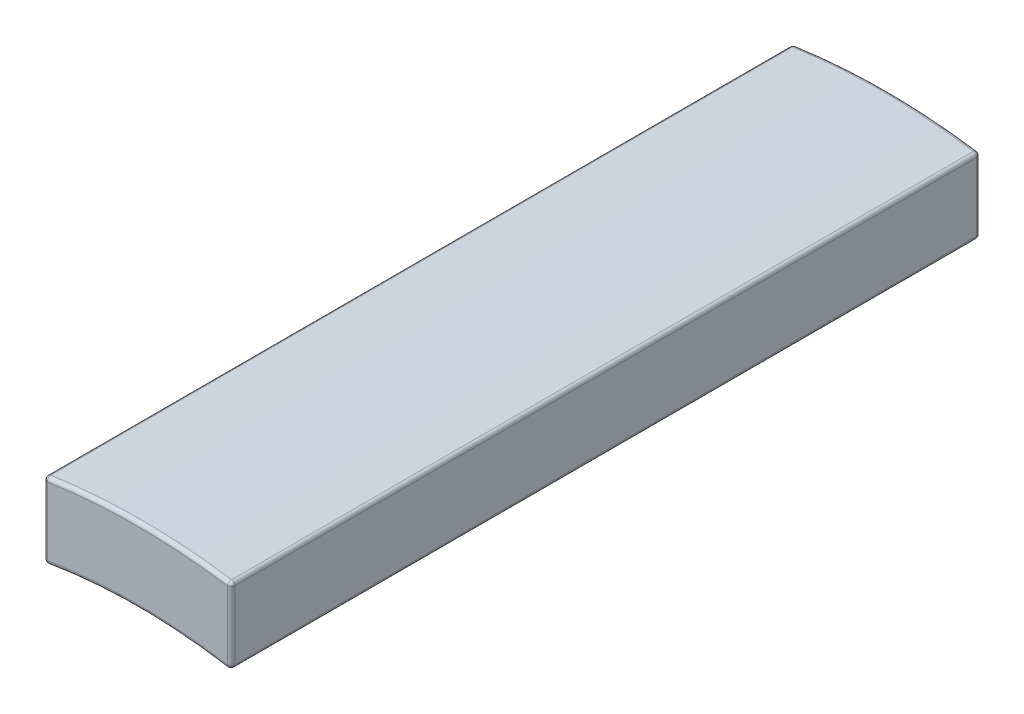
ISO-10303-21;
HEADER;
FILE_DESCRIPTION(('STEP AP214'),'2;1');
FILE_NAME('part.step','',(''),(''),'','','');
FILE_SCHEMA(('AUTOMOTIVE_DESIGN { 1 0 10303 214 1 1 1 1 }'));
ENDSEC;
DATA;
#1=APPLICATION_CONTEXT('core data for automotive mechanical design processes');
#2=APPLICATION_PROTOCOL_DEFINITION('international standard','automotive_design',2000,#1);
#3=PRODUCT_CONTEXT('',#1,'mechanical');
#4=PRODUCT('Part','Part','',(#3));
#5=PRODUCT_RELATED_PRODUCT_CATEGORY('part','',(#4));
#6=PRODUCT_DEFINITION_FORMATION('','',#4);
#7=PRODUCT_DEFINITION_CONTEXT('part definition',#1,'design');
#8=PRODUCT_DEFINITION('design','',#6,#7);
#9=PRODUCT_DEFINITION_SHAPE('','',#8);
#10=(LENGTH_UNIT() NAMED_UNIT(*) SI_UNIT(.MILLI.,.METRE.));
#11=(NAMED_UNIT(*) PLANE_ANGLE_UNIT() SI_UNIT($,.RADIAN.));
#12=(NAMED_UNIT(*) SI_UNIT($,.STERADIAN.) SOLID_ANGLE_UNIT());
#13=UNCERTAINTY_MEASURE_WITH_UNIT(LENGTH_MEASURE(1.E-05),#10,'distance_accuracy_value','');
#14=(GEOMETRIC_REPRESENTATION_CONTEXT(3) GLOBAL_UNCERTAINTY_ASSIGNED_CONTEXT((#13)) GLOBAL_UNIT_ASSIGNED_CONTEXT((#10,
#11,#12)) REPRESENTATION_CONTEXT('',''));
#15=CARTESIAN_POINT('',(0.,0.,0.));
#16=DIRECTION('',(0.,0.,1.));
#17=DIRECTION('',(1.,0.,0.));
#18=AXIS2_PLACEMENT_3D('',#15,#16,#17);
#19=CARTESIAN_POINT('',(2.4,14.3,0.1));
#20=DIRECTION('',(0.,1.,0.));
#21=DIRECTION('',(0.,0.,1.));
#22=AXIS2_PLACEMENT_3D('',#19,#20,#21);
#23=CYLINDRICAL_SURFACE('',#22,0.1);
#24=CARTESIAN_POINT('',(2.4,14.3,0.1));
#25=DIRECTION('',(0.,1.,0.));
#26=DIRECTION('',(0.,0.,1.));
#27=AXIS2_PLACEMENT_3D('',#24,#25,#26);
#28=CIRCLE('',#27,0.1);
#29=CARTESIAN_POINT('',(2.5,14.3,0.1));
#30=VERTEX_POINT('',#29);
#31=CARTESIAN_POINT('',(2.4,14.3,0.));
#32=VERTEX_POINT('',#31);
#33=EDGE_CURVE('E28',#30,#32,#28,.T.);
#34=ORIENTED_EDGE('',*,*,#33,.T.);
#35=DIRECTION('',(0.,-1.,0.));
#36=VECTOR('',#35,1.);
#37=CARTESIAN_POINT('',(2.4,14.3,0.));
#38=LINE('',#37,#36);
#39=CARTESIAN_POINT('',(2.4,16.1223447426235,0.));
#40=VERTEX_POINT('',#39);
#41=EDGE_CURVE('E219',#40,#32,#38,.T.);
#42=ORIENTED_EDGE('',*,*,#41,.F.);
#43=CARTESIAN_POINT('',(2.4,16.1223447426235,0.1));
#44=DIRECTION('',(0.,-1.,0.));
#45=DIRECTION('',(0.,0.,-1.));
#46=AXIS2_PLACEMENT_3D('',#43,#44,#45);
#47=CIRCLE('',#46,0.1);
#48=CARTESIAN_POINT('',(2.5,16.1223447426235,0.1));
#49=VERTEX_POINT('',#48);
#50=EDGE_CURVE('E11',#40,#49,#47,.T.);
#51=ORIENTED_EDGE('',*,*,#50,.T.);
#52=DIRECTION('',(0.,1.,0.));
#53=VECTOR('',#52,1.);
#54=CARTESIAN_POINT('',(2.5,14.3,0.1));
#55=LINE('',#54,#53);
#56=EDGE_CURVE('E276',#30,#49,#55,.T.);
#57=ORIENTED_EDGE('',*,*,#56,.F.);
#58=EDGE_LOOP('',(#34,#42,#51,#57));
#59=FACE_BOUND('',#58,.T.);
#60=ADVANCED_FACE('F17',(#59),#23,.T.);
#61=CARTESIAN_POINT('',(2.4,16.1223447426235,0.1));
#62=DIRECTION('',(0.,1.,0.));
#63=DIRECTION('',(1.,0.,0.));
#64=AXIS2_PLACEMENT_3D('',#61,#62,#63);
#65=SPHERICAL_SURFACE('',#64,0.1);
#66=CARTESIAN_POINT('',(2.4,16.1223447426235,0.1));
#67=DIRECTION('',(0.98910090445543,-0.147239263803684,0.));
#68=DIRECTION('',(0.147239263803684,0.98910090445543,0.));
#69=AXIS2_PLACEMENT_3D('',#66,#67,#68);
#70=CIRCLE('',#69,0.1);
#71=CARTESIAN_POINT('',(2.41472392638037,16.2212548330691,0.1));
#72=VERTEX_POINT('',#71);
#73=EDGE_CURVE('E156',#40,#72,#70,.T.);
#74=ORIENTED_EDGE('',*,*,#73,.T.);
#75=CARTESIAN_POINT('',(2.4,16.1223447426235,0.1));
#76=DIRECTION('',(0.,0.,1.));
#77=DIRECTION('',(-1.,0.,0.));
#78=AXIS2_PLACEMENT_3D('',#75,#76,#77);
#79=CIRCLE('',#78,0.1);
#80=EDGE_CURVE('E209',#49,#72,#79,.T.);
#81=ORIENTED_EDGE('',*,*,#80,.F.);
#82=ORIENTED_EDGE('',*,*,#50,.F.);
#83=EDGE_LOOP('',(#74,#81,#82));
#84=FACE_BOUND('',#83,.T.);
#85=ADVANCED_FACE('F637',(#84),#65,.T.);
#86=CARTESIAN_POINT('',(2.4,14.3,0.1));
#87=DIRECTION('',(0.,1.,0.));
#88=DIRECTION('',(1.,0.,0.));
#89=AXIS2_PLACEMENT_3D('',#86,#87,#88);
#90=SPHERICAL_SURFACE('',#89,0.1);
#91=CARTESIAN_POINT('',(2.4,14.3,0.1));
#92=DIRECTION('',(0.,0.,1.));
#93=DIRECTION('',(-1.,0.,0.));
#94=AXIS2_PLACEMENT_3D('',#91,#92,#93);
#95=CIRCLE('',#94,0.1);
#96=CARTESIAN_POINT('',(2.38344827586207,14.2013793103448,0.1));
#97=VERTEX_POINT('',#96);
#98=EDGE_CURVE('E173',#97,#30,#95,.T.);
#99=ORIENTED_EDGE('',*,*,#98,.F.);
#100=CARTESIAN_POINT('',(2.4,14.3,0.1));
#101=DIRECTION('',(0.986206896551724,-0.165517241379312,0.));
#102=DIRECTION('',(0.165517241379312,0.986206896551724,0.));
#103=AXIS2_PLACEMENT_3D('',#100,#101,#102);
#104=CIRCLE('',#103,0.1);
#105=EDGE_CURVE('E145',#97,#32,#104,.T.);
#106=ORIENTED_EDGE('',*,*,#105,.T.);
#107=ORIENTED_EDGE('',*,*,#33,.F.);
#108=EDGE_LOOP('',(#99,#106,#107));
#109=FACE_BOUND('',#108,.T.);
#110=ADVANCED_FACE('F174',(#109),#90,.T.);
#111=CARTESIAN_POINT('',(0.,0.,0.1));
#112=DIRECTION('',(0.,0.,1.));
#113=DIRECTION('',(1.,0.,0.));
#114=AXIS2_PLACEMENT_3D('',#111,#112,#113);
#115=TOROIDAL_SURFACE('',#114,16.3,0.1);
#116=CARTESIAN_POINT('',(-2.4,16.1223447426235,0.1));
#117=DIRECTION('',(0.98910090445543,0.14723926380368,0.));
#118=DIRECTION('',(-0.14723926380368,0.98910090445543,0.));
#119=AXIS2_PLACEMENT_3D('',#116,#117,#118);
#120=CIRCLE('',#119,0.1);
#121=CARTESIAN_POINT('',(-2.4,16.1223447426235,0.));
#122=VERTEX_POINT('',#121);
#123=CARTESIAN_POINT('',(-2.41472392638037,16.2212548330691,0.1));
#124=VERTEX_POINT('',#123);
#125=EDGE_CURVE('E157',#122,#124,#120,.T.);
#126=ORIENTED_EDGE('',*,*,#125,.T.);
#127=CARTESIAN_POINT('',(0.,0.,0.1));
#128=DIRECTION('',(0.,0.,1.));
#129=DIRECTION('',(1.,0.,0.));
#130=AXIS2_PLACEMENT_3D('',#127,#128,#129);
#131=CIRCLE('',#130,16.4);
#132=EDGE_CURVE('E267',#72,#124,#131,.T.);
#133=ORIENTED_EDGE('',*,*,#132,.F.);
#134=ORIENTED_EDGE('',*,*,#73,.F.);
#135=CARTESIAN_POINT('',(0.,0.,0.));
#136=DIRECTION('',(0.,0.,-1.));
#137=DIRECTION('',(1.,0.,0.));
#138=AXIS2_PLACEMENT_3D('',#135,#136,#137);
#139=CIRCLE('',#138,16.3);
#140=EDGE_CURVE('E215',#122,#40,#139,.T.);
#141=ORIENTED_EDGE('',*,*,#140,.F.);
#142=EDGE_LOOP('',(#126,#133,#134,#141));
#143=FACE_BOUND('',#142,.T.);
#144=ADVANCED_FACE('F548',(#143),#115,.T.);
#145=CARTESIAN_POINT('',(0.,0.,0.1));
#146=DIRECTION('',(0.,0.,1.));
#147=DIRECTION('',(1.,0.,0.));
#148=AXIS2_PLACEMENT_3D('',#145,#146,#147);
#149=TOROIDAL_SURFACE('',#148,14.5,0.1);
#150=CARTESIAN_POINT('',(-2.4,14.3,0.1));
#151=DIRECTION('',(0.986206896551723,0.165517241379316,0.));
#152=DIRECTION('',(-0.165517241379316,0.986206896551723,0.));
#153=AXIS2_PLACEMENT_3D('',#150,#151,#152);
#154=CIRCLE('',#153,0.1);
#155=CARTESIAN_POINT('',(-2.38344827586207,14.2013793103448,0.1));
#156=VERTEX_POINT('',#155);
#157=CARTESIAN_POINT('',(-2.4,14.3,0.));
#158=VERTEX_POINT('',#157);
#159=EDGE_CURVE('E21',#156,#158,#154,.T.);
#160=ORIENTED_EDGE('',*,*,#159,.T.);
#161=CARTESIAN_POINT('',(0.,0.,0.));
#162=DIRECTION('',(0.,0.,1.));
#163=DIRECTION('',(1.,0.,0.));
#164=AXIS2_PLACEMENT_3D('',#161,#162,#163);
#165=CIRCLE('',#164,14.5);
#166=EDGE_CURVE('E151',#32,#158,#165,.T.);
#167=ORIENTED_EDGE('',*,*,#166,.F.);
#168=ORIENTED_EDGE('',*,*,#105,.F.);
#169=CARTESIAN_POINT('',(0.,0.,0.1));
#170=DIRECTION('',(0.,0.,-1.));
#171=DIRECTION('',(1.,0.,0.));
#172=AXIS2_PLACEMENT_3D('',#169,#170,#171);
#173=CIRCLE('',#172,14.4);
#174=EDGE_CURVE('E148',#156,#97,#173,.T.);
#175=ORIENTED_EDGE('',*,*,#174,.F.);
#176=EDGE_LOOP('',(#160,#167,#168,#175));
#177=FACE_BOUND('',#176,.T.);
#178=ADVANCED_FACE('F147',(#177),#149,.T.);
#179=CARTESIAN_POINT('',(-2.4,16.1223447426235,0.1));
#180=DIRECTION('',(0.,1.,0.));
#181=DIRECTION('',(1.,0.,0.));
#182=AXIS2_PLACEMENT_3D('',#179,#180,#181);
#183=SPHERICAL_SURFACE('',#182,0.1);
#184=CARTESIAN_POINT('',(-2.4,16.1223447426235,0.1));
#185=DIRECTION('',(0.,1.,0.));
#186=DIRECTION('',(0.,0.,1.));
#187=AXIS2_PLACEMENT_3D('',#184,#185,#186);
#188=CIRCLE('',#187,0.1);
#189=CARTESIAN_POINT('',(-2.5,16.1223447426235,0.1));
#190=VERTEX_POINT('',#189);
#191=EDGE_CURVE('E251',#122,#190,#188,.T.);
#192=ORIENTED_EDGE('',*,*,#191,.T.);
#193=CARTESIAN_POINT('',(-2.4,16.1223447426235,0.1));
#194=DIRECTION('',(0.,0.,1.));
#195=DIRECTION('',(-1.,0.,0.));
#196=AXIS2_PLACEMENT_3D('',#193,#194,#195);
#197=CIRCLE('',#196,0.1);
#198=EDGE_CURVE('E227',#124,#190,#197,.T.);
#199=ORIENTED_EDGE('',*,*,#198,.F.);
#200=ORIENTED_EDGE('',*,*,#125,.F.);
#201=EDGE_LOOP('',(#192,#199,#200));
#202=FACE_BOUND('',#201,.T.);
#203=ADVANCED_FACE('F561',(#202),#183,.T.);
#204=CARTESIAN_POINT('',(-2.4,14.3,0.1));
#205=DIRECTION('',(0.,1.,0.));
#206=DIRECTION('',(1.,0.,0.));
#207=AXIS2_PLACEMENT_3D('',#204,#205,#206);
#208=SPHERICAL_SURFACE('',#207,0.1);
#209=CARTESIAN_POINT('',(-2.4,14.3,0.1));
#210=DIRECTION('',(0.,0.,1.));
#211=DIRECTION('',(-1.,0.,0.));
#212=AXIS2_PLACEMENT_3D('',#209,#210,#211);
#213=CIRCLE('',#212,0.1);
#214=CARTESIAN_POINT('',(-2.5,14.3,0.1));
#215=VERTEX_POINT('',#214);
#216=EDGE_CURVE('E244',#215,#156,#213,.T.);
#217=ORIENTED_EDGE('',*,*,#216,.F.);
#218=CARTESIAN_POINT('',(-2.4,14.3,0.1));
#219=DIRECTION('',(0.,-1.,0.));
#220=DIRECTION('',(0.,0.,-1.));
#221=AXIS2_PLACEMENT_3D('',#218,#219,#220);
#222=CIRCLE('',#221,0.1);
#223=EDGE_CURVE('E213',#215,#158,#222,.T.);
#224=ORIENTED_EDGE('',*,*,#223,.T.);
#225=ORIENTED_EDGE('',*,*,#159,.F.);
#226=EDGE_LOOP('',(#217,#224,#225));
#227=FACE_BOUND('',#226,.T.);
#228=ADVANCED_FACE('F347',(#227),#208,.T.);
#229=CARTESIAN_POINT('',(-2.4,14.3,0.1));
#230=DIRECTION('',(0.,-1.,0.));
#231=DIRECTION('',(0.,0.,-1.));
#232=AXIS2_PLACEMENT_3D('',#229,#230,#231);
#233=CYLINDRICAL_SURFACE('',#232,0.1);
#234=ORIENTED_EDGE('',*,*,#223,.F.);
#235=DIRECTION('',(0.,-1.,0.));
#236=VECTOR('',#235,1.);
#237=CARTESIAN_POINT('',(-2.5,14.3,0.1));
#238=LINE('',#237,#236);
#239=EDGE_CURVE('E250',#190,#215,#238,.T.);
#240=ORIENTED_EDGE('',*,*,#239,.F.);
#241=ORIENTED_EDGE('',*,*,#191,.F.);
#242=DIRECTION('',(0.,1.,0.));
#243=VECTOR('',#242,1.);
#244=CARTESIAN_POINT('',(-2.4,14.3,0.));
#245=LINE('',#244,#243);
#246=EDGE_CURVE('E198',#158,#122,#245,.T.);
#247=ORIENTED_EDGE('',*,*,#246,.F.);
#248=EDGE_LOOP('',(#234,#240,#241,#247));
#249=FACE_BOUND('',#248,.T.);
#250=ADVANCED_FACE('F560',(#249),#233,.T.);
#251=CARTESIAN_POINT('',(0.,0.,19.9));
#252=DIRECTION('',(0.,0.,1.));
#253=DIRECTION('',(1.,0.,0.));
#254=AXIS2_PLACEMENT_3D('',#251,#252,#253);
#255=TOROIDAL_SURFACE('',#254,14.5,0.1);
#256=CARTESIAN_POINT('',(-2.4,14.3,19.9));
#257=DIRECTION('',(0.986206896551723,0.165517241379316,0.));
#258=DIRECTION('',(-0.165517241379316,0.986206896551723,0.));
#259=AXIS2_PLACEMENT_3D('',#256,#257,#258);
#260=CIRCLE('',#259,0.1);
#261=CARTESIAN_POINT('',(-2.4,14.3,20.));
#262=VERTEX_POINT('',#261);
#263=CARTESIAN_POINT('',(-2.38344827586207,14.2013793103448,19.9));
#264=VERTEX_POINT('',#263);
#265=EDGE_CURVE('E214',#262,#264,#260,.T.);
#266=ORIENTED_EDGE('',*,*,#265,.T.);
#267=CARTESIAN_POINT('',(0.,0.,19.9));
#268=DIRECTION('',(0.,0.,1.));
#269=DIRECTION('',(1.,0.,0.));
#270=AXIS2_PLACEMENT_3D('',#267,#268,#269);
#271=CIRCLE('',#270,14.4);
#272=CARTESIAN_POINT('',(2.38344827586207,14.2013793103448,19.9));
#273=VERTEX_POINT('',#272);
#274=EDGE_CURVE('E169',#273,#264,#271,.T.);
#275=ORIENTED_EDGE('',*,*,#274,.F.);
#276=CARTESIAN_POINT('',(2.4,14.3,19.9));
#277=DIRECTION('',(-0.986206896551725,0.165517241379303,0.));
#278=DIRECTION('',(-0.165517241379303,-0.986206896551725,0.));
#279=AXIS2_PLACEMENT_3D('',#276,#277,#278);
#280=CIRCLE('',#279,0.1);
#281=CARTESIAN_POINT('',(2.4,14.3,20.));
#282=VERTEX_POINT('',#281);
#283=EDGE_CURVE('E76',#273,#282,#280,.T.);
#284=ORIENTED_EDGE('',*,*,#283,.T.);
#285=CARTESIAN_POINT('',(0.,0.,20.));
#286=DIRECTION('',(0.,0.,-1.));
#287=DIRECTION('',(1.,0.,0.));
#288=AXIS2_PLACEMENT_3D('',#285,#286,#287);
#289=CIRCLE('',#288,14.5);
#290=EDGE_CURVE('E199',#262,#282,#289,.T.);
#291=ORIENTED_EDGE('',*,*,#290,.F.);
#292=EDGE_LOOP('',(#266,#275,#284,#291));
#293=FACE_BOUND('',#292,.T.);
#294=ADVANCED_FACE('F341',(#293),#255,.T.);
#295=CARTESIAN_POINT('',(2.4,14.3,19.9));
#296=DIRECTION('',(0.,1.,0.));
#297=DIRECTION('',(1.,0.,0.));
#298=AXIS2_PLACEMENT_3D('',#295,#296,#297);
#299=SPHERICAL_SURFACE('',#298,0.1);
#300=CARTESIAN_POINT('',(2.4,14.3,19.9));
#301=DIRECTION('',(0.,0.,-1.));
#302=DIRECTION('',(-1.,0.,0.));
#303=AXIS2_PLACEMENT_3D('',#300,#301,#302);
#304=CIRCLE('',#303,0.1);
#305=CARTESIAN_POINT('',(2.5,14.3,19.9));
#306=VERTEX_POINT('',#305);
#307=EDGE_CURVE('E184',#306,#273,#304,.T.);
#308=ORIENTED_EDGE('',*,*,#307,.F.);
#309=CARTESIAN_POINT('',(2.4,14.3,19.9));
#310=DIRECTION('',(0.,-1.,0.));
#311=DIRECTION('',(0.,0.,-1.));
#312=AXIS2_PLACEMENT_3D('',#309,#310,#311);
#313=CIRCLE('',#312,0.1);
#314=EDGE_CURVE('E235',#306,#282,#313,.T.);
#315=ORIENTED_EDGE('',*,*,#314,.T.);
#316=ORIENTED_EDGE('',*,*,#283,.F.);
#317=EDGE_LOOP('',(#308,#315,#316));
#318=FACE_BOUND('',#317,.T.);
#319=ADVANCED_FACE('F686',(#318),#299,.T.);
#320=CARTESIAN_POINT('',(-2.4,14.3,19.9));
#321=DIRECTION('',(0.,1.,0.));
#322=DIRECTION('',(1.,0.,0.));
#323=AXIS2_PLACEMENT_3D('',#320,#321,#322);
#324=SPHERICAL_SURFACE('',#323,0.1);
#325=CARTESIAN_POINT('',(-2.4,14.3,19.9));
#326=DIRECTION('',(0.,-1.,0.));
#327=DIRECTION('',(0.,0.,-1.));
#328=AXIS2_PLACEMENT_3D('',#325,#326,#327);
#329=CIRCLE('',#328,0.1);
#330=CARTESIAN_POINT('',(-2.5,14.3,19.9));
#331=VERTEX_POINT('',#330);
#332=EDGE_CURVE('E258',#262,#331,#329,.T.);
#333=ORIENTED_EDGE('',*,*,#332,.T.);
#334=CARTESIAN_POINT('',(-2.4,14.3,19.9));
#335=DIRECTION('',(0.,0.,-1.));
#336=DIRECTION('',(-1.,0.,0.));
#337=AXIS2_PLACEMENT_3D('',#334,#335,#336);
#338=CIRCLE('',#337,0.1);
#339=EDGE_CURVE('E170',#264,#331,#338,.T.);
#340=ORIENTED_EDGE('',*,*,#339,.F.);
#341=ORIENTED_EDGE('',*,*,#265,.F.);
#342=EDGE_LOOP('',(#333,#340,#341));
#343=FACE_BOUND('',#342,.T.);
#344=ADVANCED_FACE('F342',(#343),#324,.T.);
#345=CARTESIAN_POINT('',(2.4,14.3,19.9));
#346=DIRECTION('',(0.,-1.,0.));
#347=DIRECTION('',(0.,0.,-1.));
#348=AXIS2_PLACEMENT_3D('',#345,#346,#347);
#349=CYLINDRICAL_SURFACE('',#348,0.1);
#350=CARTESIAN_POINT('',(2.4,16.1223447426235,19.9));
#351=DIRECTION('',(0.,-1.,0.));
#352=DIRECTION('',(0.,0.,-1.));
#353=AXIS2_PLACEMENT_3D('',#350,#351,#352);
#354=CIRCLE('',#353,0.1);
#355=CARTESIAN_POINT('',(2.5,16.1223447426235,19.9));
#356=VERTEX_POINT('',#355);
#357=CARTESIAN_POINT('',(2.4,16.1223447426235,20.));
#358=VERTEX_POINT('',#357);
#359=EDGE_CURVE('E59',#356,#358,#354,.T.);
#360=ORIENTED_EDGE('',*,*,#359,.T.);
#361=DIRECTION('',(0.,1.,0.));
#362=VECTOR('',#361,1.);
#363=CARTESIAN_POINT('',(2.4,16.1223447426235,20.));
#364=LINE('',#363,#362);
#365=EDGE_CURVE('E203',#282,#358,#364,.T.);
#366=ORIENTED_EDGE('',*,*,#365,.F.);
#367=ORIENTED_EDGE('',*,*,#314,.F.);
#368=DIRECTION('',(0.,-1.,0.));
#369=VECTOR('',#368,1.);
#370=CARTESIAN_POINT('',(2.5,14.3,19.9));
#371=LINE('',#370,#369);
#372=EDGE_CURVE('E205',#356,#306,#371,.T.);
#373=ORIENTED_EDGE('',*,*,#372,.F.);
#374=EDGE_LOOP('',(#360,#366,#367,#373));
#375=FACE_BOUND('',#374,.T.);
#376=ADVANCED_FACE('F646',(#375),#349,.T.);
#377=CARTESIAN_POINT('',(-2.4,14.3,19.9));
#378=DIRECTION('',(0.,1.,0.));
#379=DIRECTION('',(0.,0.,1.));
#380=AXIS2_PLACEMENT_3D('',#377,#378,#379);
#381=CYLINDRICAL_SURFACE('',#380,0.1);
#382=CARTESIAN_POINT('',(-2.4,16.1223447426235,19.9));
#383=DIRECTION('',(0.,-1.,0.));
#384=DIRECTION('',(0.,0.,-1.));
#385=AXIS2_PLACEMENT_3D('',#382,#383,#384);
#386=CIRCLE('',#385,0.1);
#387=CARTESIAN_POINT('',(-2.4,16.1223447426235,20.));
#388=VERTEX_POINT('',#387);
#389=CARTESIAN_POINT('',(-2.5,16.1223447426235,19.9));
#390=VERTEX_POINT('',#389);
#391=EDGE_CURVE('E193',#388,#390,#386,.T.);
#392=ORIENTED_EDGE('',*,*,#391,.T.);
#393=DIRECTION('',(0.,1.,0.));
#394=VECTOR('',#393,1.);
#395=CARTESIAN_POINT('',(-2.5,16.1223447426235,19.9));
#396=LINE('',#395,#394);
#397=EDGE_CURVE('E240',#331,#390,#396,.T.);
#398=ORIENTED_EDGE('',*,*,#397,.F.);
#399=ORIENTED_EDGE('',*,*,#332,.F.);
#400=DIRECTION('',(0.,-1.,0.));
#401=VECTOR('',#400,1.);
#402=CARTESIAN_POINT('',(-2.4,14.3,20.));
#403=LINE('',#402,#401);
#404=EDGE_CURVE('E204',#388,#262,#403,.T.);
#405=ORIENTED_EDGE('',*,*,#404,.F.);
#406=EDGE_LOOP('',(#392,#398,#399,#405));
#407=FACE_BOUND('',#406,.T.);
#408=ADVANCED_FACE('F336',(#407),#381,.T.);
#409=CARTESIAN_POINT('',(2.4,16.1223447426235,19.9));
#410=DIRECTION('',(0.,1.,0.));
#411=DIRECTION('',(1.,0.,0.));
#412=AXIS2_PLACEMENT_3D('',#409,#410,#411);
#413=SPHERICAL_SURFACE('',#412,0.1);
#414=CARTESIAN_POINT('',(2.4,16.1223447426235,19.9));
#415=DIRECTION('',(0.,0.,-1.));
#416=DIRECTION('',(-1.,0.,0.));
#417=AXIS2_PLACEMENT_3D('',#414,#415,#416);
#418=CIRCLE('',#417,0.1);
#419=CARTESIAN_POINT('',(2.41472392638037,16.2212548330691,19.9));
#420=VERTEX_POINT('',#419);
#421=EDGE_CURVE('E271',#420,#356,#418,.T.);
#422=ORIENTED_EDGE('',*,*,#421,.F.);
#423=CARTESIAN_POINT('',(2.4,16.1223447426235,19.9));
#424=DIRECTION('',(0.98910090445543,-0.14723926380368,0.));
#425=DIRECTION('',(0.14723926380368,0.98910090445543,0.));
#426=AXIS2_PLACEMENT_3D('',#423,#424,#425);
#427=CIRCLE('',#426,0.1);
#428=EDGE_CURVE('E194',#420,#358,#427,.T.);
#429=ORIENTED_EDGE('',*,*,#428,.T.);
#430=ORIENTED_EDGE('',*,*,#359,.F.);
#431=EDGE_LOOP('',(#422,#429,#430));
#432=FACE_BOUND('',#431,.T.);
#433=ADVANCED_FACE('F628',(#432),#413,.T.);
#434=CARTESIAN_POINT('',(-2.4,16.1223447426235,19.9));
#435=DIRECTION('',(0.,1.,0.));
#436=DIRECTION('',(1.,0.,0.));
#437=AXIS2_PLACEMENT_3D('',#434,#435,#436);
#438=SPHERICAL_SURFACE('',#437,0.1);
#439=CARTESIAN_POINT('',(-2.4,16.1223447426235,19.9));
#440=DIRECTION('',(-0.98910090445543,-0.14723926380368,0.));
#441=DIRECTION('',(0.14723926380368,-0.98910090445543,0.));
#442=AXIS2_PLACEMENT_3D('',#439,#440,#441);
#443=CIRCLE('',#442,0.1);
#444=CARTESIAN_POINT('',(-2.41472392638037,16.2212548330691,19.9));
#445=VERTEX_POINT('',#444);
#446=EDGE_CURVE('E191',#388,#445,#443,.T.);
#447=ORIENTED_EDGE('',*,*,#446,.T.);
#448=CARTESIAN_POINT('',(-2.4,16.1223447426235,19.9));
#449=DIRECTION('',(0.,0.,-1.));
#450=DIRECTION('',(-1.,0.,0.));
#451=AXIS2_PLACEMENT_3D('',#448,#449,#450);
#452=CIRCLE('',#451,0.1);
#453=EDGE_CURVE('E246',#390,#445,#452,.T.);
#454=ORIENTED_EDGE('',*,*,#453,.F.);
#455=ORIENTED_EDGE('',*,*,#391,.F.);
#456=EDGE_LOOP('',(#447,#454,#455));
#457=FACE_BOUND('',#456,.T.);
#458=ADVANCED_FACE('F597',(#457),#438,.T.);
#459=CARTESIAN_POINT('',(0.,0.,19.9));
#460=DIRECTION('',(0.,0.,1.));
#461=DIRECTION('',(1.,0.,0.));
#462=AXIS2_PLACEMENT_3D('',#459,#460,#461);
#463=TOROIDAL_SURFACE('',#462,16.3,0.1);
#464=ORIENTED_EDGE('',*,*,#428,.F.);
#465=CARTESIAN_POINT('',(0.,0.,19.9));
#466=DIRECTION('',(0.,0.,-1.));
#467=DIRECTION('',(1.,0.,0.));
#468=AXIS2_PLACEMENT_3D('',#465,#466,#467);
#469=CIRCLE('',#468,16.4);
#470=EDGE_CURVE('E224',#445,#420,#469,.T.);
#471=ORIENTED_EDGE('',*,*,#470,.F.);
#472=ORIENTED_EDGE('',*,*,#446,.F.);
#473=CARTESIAN_POINT('',(0.,0.,20.));
#474=DIRECTION('',(0.,0.,1.));
#475=DIRECTION('',(1.,0.,0.));
#476=AXIS2_PLACEMENT_3D('',#473,#474,#475);
#477=CIRCLE('',#476,16.3);
#478=EDGE_CURVE('E220',#358,#388,#477,.T.);
#479=ORIENTED_EDGE('',*,*,#478,.F.);
#480=EDGE_LOOP('',(#464,#471,#472,#479));
#481=FACE_BOUND('',#480,.T.);
#482=ADVANCED_FACE('F593',(#481),#463,.T.);
#483=CARTESIAN_POINT('',(2.4,14.3,0.));
#484=DIRECTION('',(0.,0.,1.));
#485=DIRECTION('',(1.,0.,0.));
#486=AXIS2_PLACEMENT_3D('',#483,#484,#485);
#487=PLANE('',#486);
#488=ORIENTED_EDGE('',*,*,#140,.T.);
#489=ORIENTED_EDGE('',*,*,#41,.T.);
#490=ORIENTED_EDGE('',*,*,#166,.T.);
#491=ORIENTED_EDGE('',*,*,#246,.T.);
#492=EDGE_LOOP('',(#488,#489,#490,#491));
#493=FACE_BOUND('',#492,.T.);
#494=ADVANCED_FACE('F579',(#493),#487,.F.);
#495=CARTESIAN_POINT('',(2.4,14.3,20.));
#496=DIRECTION('',(0.,0.,1.));
#497=DIRECTION('',(1.,0.,0.));
#498=AXIS2_PLACEMENT_3D('',#495,#496,#497);
#499=PLANE('',#498);
#500=ORIENTED_EDGE('',*,*,#404,.T.);
#501=ORIENTED_EDGE('',*,*,#290,.T.);
#502=ORIENTED_EDGE('',*,*,#365,.T.);
#503=ORIENTED_EDGE('',*,*,#478,.T.);
#504=EDGE_LOOP('',(#500,#501,#502,#503));
#505=FACE_BOUND('',#504,.T.);
#506=ADVANCED_FACE('F332',(#505),#499,.T.);
#507=CARTESIAN_POINT('',(0.,0.,20.));
#508=DIRECTION('',(0.,0.,-1.));
#509=DIRECTION('',(-1.,0.,0.));
#510=AXIS2_PLACEMENT_3D('',#507,#508,#509);
#511=CYLINDRICAL_SURFACE('',#510,14.4);
#512=DIRECTION('',(0.,0.,-1.));
#513=VECTOR('',#512,1.);
#514=CARTESIAN_POINT('',(-2.38344827586207,14.2013793103448,20.));
#515=LINE('',#514,#513);
#516=EDGE_CURVE('E166',#264,#156,#515,.T.);
#517=ORIENTED_EDGE('',*,*,#516,.T.);
#518=ORIENTED_EDGE('',*,*,#174,.T.);
#519=DIRECTION('',(0.,0.,-1.));
#520=VECTOR('',#519,1.);
#521=CARTESIAN_POINT('',(2.38344827586207,14.2013793103448,20.));
#522=LINE('',#521,#520);
#523=EDGE_CURVE('E164',#273,#97,#522,.T.);
#524=ORIENTED_EDGE('',*,*,#523,.F.);
#525=ORIENTED_EDGE('',*,*,#274,.T.);
#526=EDGE_LOOP('',(#517,#518,#524,#525));
#527=FACE_BOUND('',#526,.T.);
#528=ADVANCED_FACE('F161',(#527),#511,.F.);
#529=CARTESIAN_POINT('',(-2.4,14.3,20.));
#530=DIRECTION('',(0.,0.,-1.));
#531=DIRECTION('',(-1.,0.,0.));
#532=AXIS2_PLACEMENT_3D('',#529,#530,#531);
#533=CYLINDRICAL_SURFACE('',#532,0.1);
#534=DIRECTION('',(0.,0.,-1.));
#535=VECTOR('',#534,1.);
#536=CARTESIAN_POINT('',(-2.5,14.3,20.));
#537=LINE('',#536,#535);
#538=EDGE_CURVE('E245',#331,#215,#537,.T.);
#539=ORIENTED_EDGE('',*,*,#538,.T.);
#540=ORIENTED_EDGE('',*,*,#216,.T.);
#541=ORIENTED_EDGE('',*,*,#516,.F.);
#542=ORIENTED_EDGE('',*,*,#339,.T.);
#543=EDGE_LOOP('',(#539,#540,#541,#542));
#544=FACE_BOUND('',#543,.T.);
#545=ADVANCED_FACE('F344',(#544),#533,.T.);
#546=CARTESIAN_POINT('',(-2.5,14.3,20.));
#547=DIRECTION('',(1.,0.,0.));
#548=DIRECTION('',(0.,1.,0.));
#549=AXIS2_PLACEMENT_3D('',#546,#547,#548);
#550=PLANE('',#549);
#551=DIRECTION('',(0.,0.,-1.));
#552=VECTOR('',#551,1.);
#553=CARTESIAN_POINT('',(-2.5,16.1223447426235,20.));
#554=LINE('',#553,#552);
#555=EDGE_CURVE('E239',#390,#190,#554,.T.);
#556=ORIENTED_EDGE('',*,*,#555,.T.);
#557=ORIENTED_EDGE('',*,*,#239,.T.);
#558=ORIENTED_EDGE('',*,*,#538,.F.);
#559=ORIENTED_EDGE('',*,*,#397,.T.);
#560=EDGE_LOOP('',(#556,#557,#558,#559));
#561=FACE_BOUND('',#560,.T.);
#562=ADVANCED_FACE('F701',(#561),#550,.F.);
#563=CARTESIAN_POINT('',(-2.4,16.1223447426235,20.));
#564=DIRECTION('',(0.,0.,-1.));
#565=DIRECTION('',(-1.,0.,0.));
#566=AXIS2_PLACEMENT_3D('',#563,#564,#565);
#567=CYLINDRICAL_SURFACE('',#566,0.1);
#568=DIRECTION('',(0.,0.,-1.));
#569=VECTOR('',#568,1.);
#570=CARTESIAN_POINT('',(-2.41472392638037,16.2212548330691,20.));
#571=LINE('',#570,#569);
#572=EDGE_CURVE('E228',#445,#124,#571,.T.);
#573=ORIENTED_EDGE('',*,*,#572,.T.);
#574=ORIENTED_EDGE('',*,*,#198,.T.);
#575=ORIENTED_EDGE('',*,*,#555,.F.);
#576=ORIENTED_EDGE('',*,*,#453,.T.);
#577=EDGE_LOOP('',(#573,#574,#575,#576));
#578=FACE_BOUND('',#577,.T.);
#579=ADVANCED_FACE('F19',(#578),#567,.T.);
#580=CARTESIAN_POINT('',(0.,0.,20.));
#581=DIRECTION('',(0.,0.,-1.));
#582=DIRECTION('',(-1.,0.,0.));
#583=AXIS2_PLACEMENT_3D('',#580,#581,#582);
#584=CYLINDRICAL_SURFACE('',#583,16.4);
#585=DIRECTION('',(0.,0.,-1.));
#586=VECTOR('',#585,1.);
#587=CARTESIAN_POINT('',(2.41472392638037,16.2212548330691,20.));
#588=LINE('',#587,#586);
#589=EDGE_CURVE('E291',#420,#72,#588,.T.);
#590=ORIENTED_EDGE('',*,*,#589,.T.);
#591=ORIENTED_EDGE('',*,*,#132,.T.);
#592=ORIENTED_EDGE('',*,*,#572,.F.);
#593=ORIENTED_EDGE('',*,*,#470,.T.);
#594=EDGE_LOOP('',(#590,#591,#592,#593));
#595=FACE_BOUND('',#594,.T.);
#596=ADVANCED_FACE('F587',(#595),#584,.T.);
#597=CARTESIAN_POINT('',(2.4,16.1223447426235,20.));
#598=DIRECTION('',(0.,0.,-1.));
#599=DIRECTION('',(-1.,0.,0.));
#600=AXIS2_PLACEMENT_3D('',#597,#598,#599);
#601=CYLINDRICAL_SURFACE('',#600,0.1);
#602=DIRECTION('',(0.,0.,-1.));
#603=VECTOR('',#602,1.);
#604=CARTESIAN_POINT('',(2.5,16.1223447426235,20.));
#605=LINE('',#604,#603);
#606=EDGE_CURVE('E210',#356,#49,#605,.T.);
#607=ORIENTED_EDGE('',*,*,#606,.T.);
#608=ORIENTED_EDGE('',*,*,#80,.T.);
#609=ORIENTED_EDGE('',*,*,#589,.F.);
#610=ORIENTED_EDGE('',*,*,#421,.T.);
#611=EDGE_LOOP('',(#607,#608,#609,#610));
#612=FACE_BOUND('',#611,.T.);
#613=ADVANCED_FACE('F570',(#612),#601,.T.);
#614=CARTESIAN_POINT('',(2.5,14.3,20.));
#615=DIRECTION('',(-1.,0.,0.));
#616=DIRECTION('',(0.,0.,1.));
#617=AXIS2_PLACEMENT_3D('',#614,#615,#616);
#618=PLANE('',#617);
#619=DIRECTION('',(0.,0.,-1.));
#620=VECTOR('',#619,1.);
#621=CARTESIAN_POINT('',(2.5,14.3,20.));
#622=LINE('',#621,#620);
#623=EDGE_CURVE('E179',#306,#30,#622,.T.);
#624=ORIENTED_EDGE('',*,*,#623,.T.);
#625=ORIENTED_EDGE('',*,*,#56,.T.);
#626=ORIENTED_EDGE('',*,*,#606,.F.);
#627=ORIENTED_EDGE('',*,*,#372,.T.);
#628=EDGE_LOOP('',(#624,#625,#626,#627));
#629=FACE_BOUND('',#628,.T.);
#630=ADVANCED_FACE('F566',(#629),#618,.F.);
#631=CARTESIAN_POINT('',(2.4,14.3,20.));
#632=DIRECTION('',(0.,0.,-1.));
#633=DIRECTION('',(-1.,0.,0.));
#634=AXIS2_PLACEMENT_3D('',#631,#632,#633);
#635=CYLINDRICAL_SURFACE('',#634,0.1);
#636=ORIENTED_EDGE('',*,*,#523,.T.);
#637=ORIENTED_EDGE('',*,*,#98,.T.);
#638=ORIENTED_EDGE('',*,*,#623,.F.);
#639=ORIENTED_EDGE('',*,*,#307,.T.);
#640=EDGE_LOOP('',(#636,#637,#638,#639));
#641=FACE_BOUND('',#640,.T.);
#642=ADVANCED_FACE('F182',(#641),#635,.T.);
#643=CLOSED_SHELL('',(#60,#85,#110,#144,#178,#203,#228,#250,#294,#319,#344,#376,#408,#433,#458,
#482,#494,#506,#528,#545,#562,#579,#596,#613,#630,#642));
#644=MANIFOLD_SOLID_BREP('B1',#643);
#645=ADVANCED_BREP_SHAPE_REPRESENTATION('',(#18,#644),#14);
#646=SHAPE_DEFINITION_REPRESENTATION(#9,#645);
ENDSEC;
END-ISO-10303-21;
